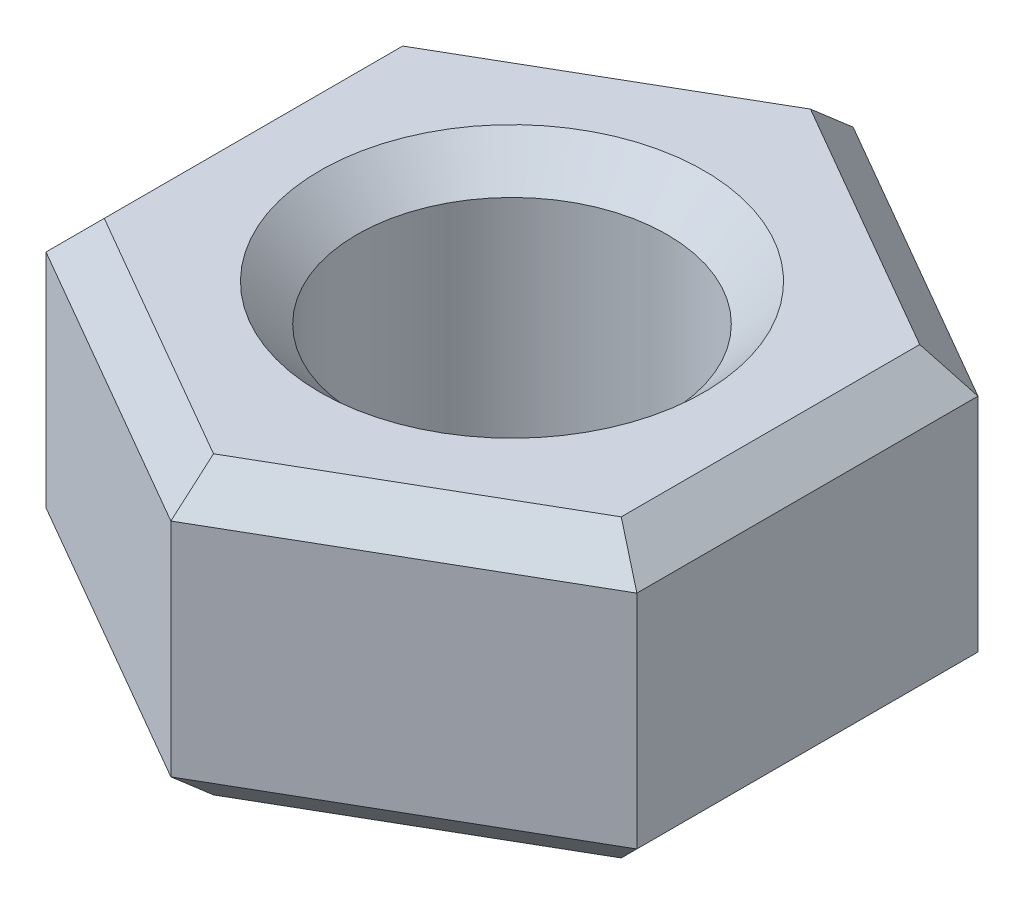
ISO-10303-21;
HEADER;
FILE_DESCRIPTION(('STEP AP214'),'2;1');
FILE_NAME('part.step','',(''),(''),'','','');
FILE_SCHEMA(('AUTOMOTIVE_DESIGN { 1 0 10303 214 1 1 1 1 }'));
ENDSEC;
DATA;
#1=APPLICATION_CONTEXT('core data for automotive mechanical design processes');
#2=APPLICATION_PROTOCOL_DEFINITION('international standard','automotive_design',2000,#1);
#3=PRODUCT_CONTEXT('',#1,'mechanical');
#4=PRODUCT('Part','Part','',(#3));
#5=PRODUCT_RELATED_PRODUCT_CATEGORY('part','',(#4));
#6=PRODUCT_DEFINITION_FORMATION('','',#4);
#7=PRODUCT_DEFINITION_CONTEXT('part definition',#1,'design');
#8=PRODUCT_DEFINITION('design','',#6,#7);
#9=PRODUCT_DEFINITION_SHAPE('','',#8);
#10=(LENGTH_UNIT() NAMED_UNIT(*) SI_UNIT(.MILLI.,.METRE.));
#11=(NAMED_UNIT(*) PLANE_ANGLE_UNIT() SI_UNIT($,.RADIAN.));
#12=(NAMED_UNIT(*) SI_UNIT($,.STERADIAN.) SOLID_ANGLE_UNIT());
#13=UNCERTAINTY_MEASURE_WITH_UNIT(LENGTH_MEASURE(1.E-05),#10,'distance_accuracy_value','');
#14=(GEOMETRIC_REPRESENTATION_CONTEXT(3) GLOBAL_UNCERTAINTY_ASSIGNED_CONTEXT((#13)) GLOBAL_UNIT_ASSIGNED_CONTEXT((#10,
#11,#12)) REPRESENTATION_CONTEXT('',''));
#15=CARTESIAN_POINT('',(0.,0.,0.));
#16=DIRECTION('',(0.,0.,1.));
#17=DIRECTION('',(1.,0.,0.));
#18=AXIS2_PLACEMENT_3D('',#15,#16,#17);
#19=CARTESIAN_POINT('',(0.,4.,-4.61880215351701));
#20=DIRECTION('',(0.,1.,0.));
#21=DIRECTION('',(0.,0.,1.));
#22=AXIS2_PLACEMENT_3D('',#19,#20,#21);
#23=PLANE('',#22);
#24=CARTESIAN_POINT('',(0.,4.00000000007594,0.));
#25=DIRECTION('',(0.,1.,0.));
#26=DIRECTION('',(0.,0.,1.));
#27=AXIS2_PLACEMENT_3D('',#24,#25,#26);
#28=CIRCLE('',#27,2.59999999997262);
#29=CARTESIAN_POINT('',(0.,4.00000000007594,2.59999999997262));
#30=VERTEX_POINT('',#29);
#31=EDGE_CURVE('E20',#30,#30,#28,.F.);
#32=ORIENTED_EDGE('',*,*,#31,.T.);
#33=EDGE_LOOP('',(#32));
#34=FACE_BOUND('',#33,.T.);
#35=DIRECTION('',(0.866025403784439,0.,0.5));
#36=VECTOR('',#35,1.);
#37=CARTESIAN_POINT('',(0.,4.,-4.04145188432738));
#38=LINE('',#37,#36);
#39=CARTESIAN_POINT('',(0.,4.,-4.04145188432738));
#40=VERTEX_POINT('',#39);
#41=CARTESIAN_POINT('',(3.5,4.,-2.02072594216369));
#42=VERTEX_POINT('',#41);
#43=EDGE_CURVE('E139',#40,#42,#38,.T.);
#44=ORIENTED_EDGE('',*,*,#43,.F.);
#45=DIRECTION('',(0.866025403784439,0.,-0.5));
#46=VECTOR('',#45,1.);
#47=CARTESIAN_POINT('',(-3.5,4.,-2.02072594216369));
#48=LINE('',#47,#46);
#49=CARTESIAN_POINT('',(-3.5,4.,-2.02072594216369));
#50=VERTEX_POINT('',#49);
#51=EDGE_CURVE('E121',#50,#40,#48,.T.);
#52=ORIENTED_EDGE('',*,*,#51,.F.);
#53=DIRECTION('',(0.,0.,1.));
#54=VECTOR('',#53,1.);
#55=CARTESIAN_POINT('',(-3.5,4.,-4.61880215351701));
#56=LINE('',#55,#54);
#57=CARTESIAN_POINT('',(-3.5,4.,2.02072594216369));
#58=VERTEX_POINT('',#57);
#59=EDGE_CURVE('E117',#58,#50,#56,.F.);
#60=ORIENTED_EDGE('',*,*,#59,.F.);
#61=DIRECTION('',(-0.866025403784439,0.,-0.5));
#62=VECTOR('',#61,1.);
#63=CARTESIAN_POINT('',(0.,4.,4.04145188432738));
#64=LINE('',#63,#62);
#65=CARTESIAN_POINT('',(0.,4.,4.04145188432738));
#66=VERTEX_POINT('',#65);
#67=EDGE_CURVE('E108',#66,#58,#64,.T.);
#68=ORIENTED_EDGE('',*,*,#67,.F.);
#69=DIRECTION('',(-0.866025403784439,0.,0.5));
#70=VECTOR('',#69,1.);
#71=CARTESIAN_POINT('',(3.5,4.,2.02072594216369));
#72=LINE('',#71,#70);
#73=CARTESIAN_POINT('',(3.5,4.,2.02072594216369));
#74=VERTEX_POINT('',#73);
#75=EDGE_CURVE('E103',#74,#66,#72,.T.);
#76=ORIENTED_EDGE('',*,*,#75,.F.);
#77=DIRECTION('',(0.,0.,1.));
#78=VECTOR('',#77,1.);
#79=CARTESIAN_POINT('',(3.5,4.,-4.61880215351701));
#80=LINE('',#79,#78);
#81=EDGE_CURVE('E133',#42,#74,#80,.T.);
#82=ORIENTED_EDGE('',*,*,#81,.F.);
#83=EDGE_LOOP('',(#44,#52,#60,#68,#76,#82));
#84=FACE_BOUND('',#83,.T.);
#85=ADVANCED_FACE('F17',(#34,#84),#23,.T.);
#86=CARTESIAN_POINT('',(-3.5,4.,-4.61880215351701));
#87=DIRECTION('',(-0.707106781186549,0.707106781186546,0.));
#88=DIRECTION('',(-0.707106781186546,-0.707106781186549,0.));
#89=AXIS2_PLACEMENT_3D('',#86,#87,#88);
#90=PLANE('',#89);
#91=DIRECTION('',(0.654653670707976,0.654653670707978,0.377964473009228));
#92=VECTOR('',#91,1.);
#93=CARTESIAN_POINT('',(-4.,3.5,-2.30940107675851));
#94=LINE('',#93,#92);
#95=CARTESIAN_POINT('',(-4.,3.5,-2.30940107675851));
#96=VERTEX_POINT('',#95);
#97=EDGE_CURVE('E144',#96,#50,#94,.T.);
#98=ORIENTED_EDGE('',*,*,#97,.F.);
#99=DIRECTION('',(0.,0.,-1.));
#100=VECTOR('',#99,1.);
#101=CARTESIAN_POINT('',(-4.,3.5,-2.3094010767585));
#102=LINE('',#101,#100);
#103=CARTESIAN_POINT('',(-4.,3.5,2.3094010767585));
#104=VERTEX_POINT('',#103);
#105=EDGE_CURVE('E127',#96,#104,#102,.F.);
#106=ORIENTED_EDGE('',*,*,#105,.T.);
#107=DIRECTION('',(-0.654653670707976,-0.654653670707978,0.377964473009227));
#108=VECTOR('',#107,1.);
#109=CARTESIAN_POINT('',(-3.5,4.,2.02072594216369));
#110=LINE('',#109,#108);
#111=EDGE_CURVE('E113',#58,#104,#110,.T.);
#112=ORIENTED_EDGE('',*,*,#111,.F.);
#113=ORIENTED_EDGE('',*,*,#59,.T.);
#114=EDGE_LOOP('',(#98,#106,#112,#113));
#115=FACE_BOUND('',#114,.T.);
#116=ADVANCED_FACE('F126',(#115),#90,.T.);
#117=CARTESIAN_POINT('',(-3.75,4.,1.87638837486628));
#118=DIRECTION('',(-0.353553390593274,0.707106781186546,0.612372435695796));
#119=DIRECTION('',(0.,-0.654653670707978,0.755928946018453));
#120=AXIS2_PLACEMENT_3D('',#117,#118,#119);
#121=PLANE('',#120);
#122=ORIENTED_EDGE('',*,*,#111,.T.);
#123=DIRECTION('',(-0.866025403784439,0.,-0.5));
#124=VECTOR('',#123,1.);
#125=CARTESIAN_POINT('',(-4.,3.5,2.3094010767585));
#126=LINE('',#125,#124);
#127=CARTESIAN_POINT('',(0.,3.5,4.61880215351701));
#128=VERTEX_POINT('',#127);
#129=EDGE_CURVE('E156',#104,#128,#126,.F.);
#130=ORIENTED_EDGE('',*,*,#129,.T.);
#131=DIRECTION('',(0.,-0.654653670707978,0.755928946018454));
#132=VECTOR('',#131,1.);
#133=CARTESIAN_POINT('',(0.,5.07142857142857,2.8042727360639));
#134=LINE('',#133,#132);
#135=EDGE_CURVE('E115',#66,#128,#134,.T.);
#136=ORIENTED_EDGE('',*,*,#135,.F.);
#137=ORIENTED_EDGE('',*,*,#67,.T.);
#138=EDGE_LOOP('',(#122,#130,#136,#137));
#139=FACE_BOUND('',#138,.T.);
#140=ADVANCED_FACE('F110',(#139),#121,.T.);
#141=CARTESIAN_POINT('',(3.75,4.,1.87638837486628));
#142=DIRECTION('',(0.353553390593274,0.707106781186547,0.612372435695795));
#143=DIRECTION('',(0.,-0.654653670707978,0.755928946018454));
#144=AXIS2_PLACEMENT_3D('',#141,#142,#143);
#145=PLANE('',#144);
#146=ORIENTED_EDGE('',*,*,#135,.T.);
#147=DIRECTION('',(-0.866025403784439,0.,0.5));
#148=VECTOR('',#147,1.);
#149=CARTESIAN_POINT('',(0.,3.5,4.61880215351701));
#150=LINE('',#149,#148);
#151=CARTESIAN_POINT('',(4.,3.5,2.3094010767585));
#152=VERTEX_POINT('',#151);
#153=EDGE_CURVE('E161',#128,#152,#150,.F.);
#154=ORIENTED_EDGE('',*,*,#153,.T.);
#155=DIRECTION('',(0.654653670707976,-0.654653670707978,0.377964473009227));
#156=VECTOR('',#155,1.);
#157=CARTESIAN_POINT('',(3.5,4.,2.02072594216369));
#158=LINE('',#157,#156);
#159=EDGE_CURVE('E135',#74,#152,#158,.T.);
#160=ORIENTED_EDGE('',*,*,#159,.F.);
#161=ORIENTED_EDGE('',*,*,#75,.T.);
#162=EDGE_LOOP('',(#146,#154,#160,#161));
#163=FACE_BOUND('',#162,.T.);
#164=ADVANCED_FACE('F475',(#163),#145,.T.);
#165=CARTESIAN_POINT('',(3.5,4.,-4.61880215351701));
#166=DIRECTION('',(0.707106781186549,0.707106781186546,0.));
#167=DIRECTION('',(-0.707106781186546,0.707106781186549,0.));
#168=AXIS2_PLACEMENT_3D('',#165,#166,#167);
#169=PLANE('',#168);
#170=ORIENTED_EDGE('',*,*,#159,.T.);
#171=DIRECTION('',(0.,0.,1.));
#172=VECTOR('',#171,1.);
#173=CARTESIAN_POINT('',(4.,3.5,2.3094010767585));
#174=LINE('',#173,#172);
#175=CARTESIAN_POINT('',(4.,3.5,-2.3094010767585));
#176=VERTEX_POINT('',#175);
#177=EDGE_CURVE('E167',#152,#176,#174,.F.);
#178=ORIENTED_EDGE('',*,*,#177,.T.);
#179=DIRECTION('',(0.654653670707977,-0.654653670707978,-0.377964473009227));
#180=VECTOR('',#179,1.);
#181=CARTESIAN_POINT('',(3.5,4.,-2.02072594216369));
#182=LINE('',#181,#180);
#183=EDGE_CURVE('E137',#42,#176,#182,.T.);
#184=ORIENTED_EDGE('',*,*,#183,.F.);
#185=ORIENTED_EDGE('',*,*,#81,.T.);
#186=EDGE_LOOP('',(#170,#178,#184,#185));
#187=FACE_BOUND('',#186,.T.);
#188=ADVANCED_FACE('F466',(#187),#169,.T.);
#189=CARTESIAN_POINT('',(-0.25,4.,-4.18578945162479));
#190=DIRECTION('',(0.353553390593275,0.707106781186546,-0.612372435695796));
#191=DIRECTION('',(0.,0.654653670707979,0.755928946018453));
#192=AXIS2_PLACEMENT_3D('',#189,#190,#191);
#193=PLANE('',#192);
#194=DIRECTION('',(0.,0.654653670707978,0.755928946018454));
#195=VECTOR('',#194,1.);
#196=CARTESIAN_POINT('',(0.,3.92857142857143,-4.12393049421161));
#197=LINE('',#196,#195);
#198=CARTESIAN_POINT('',(0.,3.5,-4.61880215351701));
#199=VERTEX_POINT('',#198);
#200=EDGE_CURVE('E142',#40,#199,#197,.F.);
#201=ORIENTED_EDGE('',*,*,#200,.F.);
#202=ORIENTED_EDGE('',*,*,#43,.T.);
#203=ORIENTED_EDGE('',*,*,#183,.T.);
#204=DIRECTION('',(0.866025403784439,0.,0.5));
#205=VECTOR('',#204,1.);
#206=CARTESIAN_POINT('',(4.,3.5,-2.3094010767585));
#207=LINE('',#206,#205);
#208=EDGE_CURVE('E173',#176,#199,#207,.F.);
#209=ORIENTED_EDGE('',*,*,#208,.T.);
#210=EDGE_LOOP('',(#201,#202,#203,#209));
#211=FACE_BOUND('',#210,.T.);
#212=ADVANCED_FACE('F268',(#211),#193,.T.);
#213=CARTESIAN_POINT('',(0.250000000000002,4.,-4.18578945162479));
#214=DIRECTION('',(-0.353553390593274,0.707106781186547,-0.612372435695795));
#215=DIRECTION('',(0.,0.654653670707978,0.755928946018454));
#216=AXIS2_PLACEMENT_3D('',#213,#214,#215);
#217=PLANE('',#216);
#218=ORIENTED_EDGE('',*,*,#97,.T.);
#219=ORIENTED_EDGE('',*,*,#51,.T.);
#220=ORIENTED_EDGE('',*,*,#200,.T.);
#221=DIRECTION('',(0.866025403784439,0.,-0.5));
#222=VECTOR('',#221,1.);
#223=CARTESIAN_POINT('',(0.,3.5,-4.61880215351701));
#224=LINE('',#223,#222);
#225=EDGE_CURVE('E179',#199,#96,#224,.F.);
#226=ORIENTED_EDGE('',*,*,#225,.T.);
#227=EDGE_LOOP('',(#218,#219,#220,#226));
#228=FACE_BOUND('',#227,.T.);
#229=ADVANCED_FACE('F264',(#228),#217,.T.);
#230=CARTESIAN_POINT('',(0.,4.00000000007594,0.));
#231=DIRECTION('',(0.,1.,0.));
#232=DIRECTION('',(0.,0.,1.));
#233=AXIS2_PLACEMENT_3D('',#230,#231,#232);
#234=CONICAL_SURFACE('',#233,2.59999999997262,0.785398163397448);
#235=CARTESIAN_POINT('',(0.,3.5,0.));
#236=DIRECTION('',(0.,-1.,0.));
#237=DIRECTION('',(0.,0.,-1.));
#238=AXIS2_PLACEMENT_3D('',#235,#236,#237);
#239=CIRCLE('',#238,2.1);
#240=CARTESIAN_POINT('',(0.,3.5,-2.1));
#241=VERTEX_POINT('',#240);
#242=EDGE_CURVE('E147',#241,#241,#239,.T.);
#243=ORIENTED_EDGE('',*,*,#242,.T.);
#244=EDGE_LOOP('',(#243));
#245=FACE_BOUND('',#244,.T.);
#246=ORIENTED_EDGE('',*,*,#31,.F.);
#247=EDGE_LOOP('',(#246));
#248=FACE_BOUND('',#247,.T.);
#249=ADVANCED_FACE('F288',(#245,#248),#234,.F.);
#250=CARTESIAN_POINT('',(-4.,4.,-2.3094010767585));
#251=DIRECTION('',(1.,0.,0.));
#252=DIRECTION('',(0.,0.,-1.));
#253=AXIS2_PLACEMENT_3D('',#250,#251,#252);
#254=PLANE('',#253);
#255=DIRECTION('',(0.,1.,0.));
#256=VECTOR('',#255,1.);
#257=CARTESIAN_POINT('',(-4.,4.,2.3094010767585));
#258=LINE('',#257,#256);
#259=CARTESIAN_POINT('',(-4.,0.499999999999999,2.30940107675851));
#260=VERTEX_POINT('',#259);
#261=EDGE_CURVE('E153',#260,#104,#258,.T.);
#262=ORIENTED_EDGE('',*,*,#261,.T.);
#263=ORIENTED_EDGE('',*,*,#105,.F.);
#264=DIRECTION('',(0.,1.,0.));
#265=VECTOR('',#264,1.);
#266=CARTESIAN_POINT('',(-4.,4.,-2.30940107675851));
#267=LINE('',#266,#265);
#268=CARTESIAN_POINT('',(-4.,0.499999999999999,-2.30940107675851));
#269=VERTEX_POINT('',#268);
#270=EDGE_CURVE('E151',#96,#269,#267,.F.);
#271=ORIENTED_EDGE('',*,*,#270,.T.);
#272=DIRECTION('',(0.,0.,1.));
#273=VECTOR('',#272,1.);
#274=CARTESIAN_POINT('',(-4.,0.499999999999999,-2.3094010767585));
#275=LINE('',#274,#273);
#276=EDGE_CURVE('E150',#269,#260,#275,.T.);
#277=ORIENTED_EDGE('',*,*,#276,.T.);
#278=EDGE_LOOP('',(#262,#263,#271,#277));
#279=FACE_BOUND('',#278,.T.);
#280=ADVANCED_FACE('F259',(#279),#254,.F.);
#281=CARTESIAN_POINT('',(-4.,4.,2.3094010767585));
#282=DIRECTION('',(0.5,0.,-0.866025403784439));
#283=DIRECTION('',(-0.866025403784439,0.,-0.5));
#284=AXIS2_PLACEMENT_3D('',#281,#282,#283);
#285=PLANE('',#284);
#286=DIRECTION('',(0.,1.,0.));
#287=VECTOR('',#286,1.);
#288=CARTESIAN_POINT('',(0.,4.,4.61880215351701));
#289=LINE('',#288,#287);
#290=CARTESIAN_POINT('',(0.,0.499999999999999,4.61880215351701));
#291=VERTEX_POINT('',#290);
#292=EDGE_CURVE('E158',#291,#128,#289,.T.);
#293=ORIENTED_EDGE('',*,*,#292,.T.);
#294=ORIENTED_EDGE('',*,*,#129,.F.);
#295=ORIENTED_EDGE('',*,*,#261,.F.);
#296=DIRECTION('',(0.866025403784439,0.,0.5));
#297=VECTOR('',#296,1.);
#298=CARTESIAN_POINT('',(-4.,0.499999999999999,2.3094010767585));
#299=LINE('',#298,#297);
#300=EDGE_CURVE('E194',#260,#291,#299,.T.);
#301=ORIENTED_EDGE('',*,*,#300,.T.);
#302=EDGE_LOOP('',(#293,#294,#295,#301));
#303=FACE_BOUND('',#302,.T.);
#304=ADVANCED_FACE('F279',(#303),#285,.F.);
#305=CARTESIAN_POINT('',(0.,4.,4.61880215351701));
#306=DIRECTION('',(-0.5,0.,-0.866025403784439));
#307=DIRECTION('',(-0.866025403784439,0.,0.5));
#308=AXIS2_PLACEMENT_3D('',#305,#306,#307);
#309=PLANE('',#308);
#310=DIRECTION('',(0.,1.,0.));
#311=VECTOR('',#310,1.);
#312=CARTESIAN_POINT('',(4.,4.,2.3094010767585));
#313=LINE('',#312,#311);
#314=CARTESIAN_POINT('',(4.,0.499999999999999,2.30940107675851));
#315=VERTEX_POINT('',#314);
#316=EDGE_CURVE('E164',#315,#152,#313,.T.);
#317=ORIENTED_EDGE('',*,*,#316,.T.);
#318=ORIENTED_EDGE('',*,*,#153,.F.);
#319=ORIENTED_EDGE('',*,*,#292,.F.);
#320=DIRECTION('',(0.866025403784439,0.,-0.5));
#321=VECTOR('',#320,1.);
#322=CARTESIAN_POINT('',(0.,0.499999999999998,4.61880215351701));
#323=LINE('',#322,#321);
#324=EDGE_CURVE('E200',#291,#315,#323,.T.);
#325=ORIENTED_EDGE('',*,*,#324,.T.);
#326=EDGE_LOOP('',(#317,#318,#319,#325));
#327=FACE_BOUND('',#326,.T.);
#328=ADVANCED_FACE('F277',(#327),#309,.F.);
#329=CARTESIAN_POINT('',(4.,4.,2.3094010767585));
#330=DIRECTION('',(-1.,0.,0.));
#331=DIRECTION('',(0.,0.,1.));
#332=AXIS2_PLACEMENT_3D('',#329,#330,#331);
#333=PLANE('',#332);
#334=DIRECTION('',(0.,1.,0.));
#335=VECTOR('',#334,1.);
#336=CARTESIAN_POINT('',(4.,4.,-2.3094010767585));
#337=LINE('',#336,#335);
#338=CARTESIAN_POINT('',(4.,0.499999999999999,-2.3094010767585));
#339=VERTEX_POINT('',#338);
#340=EDGE_CURVE('E170',#339,#176,#337,.T.);
#341=ORIENTED_EDGE('',*,*,#340,.T.);
#342=ORIENTED_EDGE('',*,*,#177,.F.);
#343=ORIENTED_EDGE('',*,*,#316,.F.);
#344=DIRECTION('',(0.,0.,1.));
#345=VECTOR('',#344,1.);
#346=CARTESIAN_POINT('',(4.,0.499999999999999,2.3094010767585));
#347=LINE('',#346,#345);
#348=EDGE_CURVE('E206',#315,#339,#347,.F.);
#349=ORIENTED_EDGE('',*,*,#348,.T.);
#350=EDGE_LOOP('',(#341,#342,#343,#349));
#351=FACE_BOUND('',#350,.T.);
#352=ADVANCED_FACE('F274',(#351),#333,.F.);
#353=CARTESIAN_POINT('',(4.,4.,-2.3094010767585));
#354=DIRECTION('',(-0.5,0.,0.866025403784439));
#355=DIRECTION('',(0.866025403784439,0.,0.5));
#356=AXIS2_PLACEMENT_3D('',#353,#354,#355);
#357=PLANE('',#356);
#358=DIRECTION('',(0.,1.,0.));
#359=VECTOR('',#358,1.);
#360=CARTESIAN_POINT('',(0.,4.,-4.61880215351701));
#361=LINE('',#360,#359);
#362=CARTESIAN_POINT('',(0.,0.499999999999998,-4.61880215351701));
#363=VERTEX_POINT('',#362);
#364=EDGE_CURVE('E176',#363,#199,#361,.T.);
#365=ORIENTED_EDGE('',*,*,#364,.T.);
#366=ORIENTED_EDGE('',*,*,#208,.F.);
#367=ORIENTED_EDGE('',*,*,#340,.F.);
#368=DIRECTION('',(-0.866025403784438,0.,-0.5));
#369=VECTOR('',#368,1.);
#370=CARTESIAN_POINT('',(4.,0.499999999999999,-2.3094010767585));
#371=LINE('',#370,#369);
#372=EDGE_CURVE('E212',#339,#363,#371,.T.);
#373=ORIENTED_EDGE('',*,*,#372,.T.);
#374=EDGE_LOOP('',(#365,#366,#367,#373));
#375=FACE_BOUND('',#374,.T.);
#376=ADVANCED_FACE('F271',(#375),#357,.F.);
#377=CARTESIAN_POINT('',(0.,4.,-4.61880215351701));
#378=DIRECTION('',(0.5,0.,0.866025403784439));
#379=DIRECTION('',(0.866025403784439,0.,-0.5));
#380=AXIS2_PLACEMENT_3D('',#377,#378,#379);
#381=PLANE('',#380);
#382=ORIENTED_EDGE('',*,*,#270,.F.);
#383=ORIENTED_EDGE('',*,*,#225,.F.);
#384=ORIENTED_EDGE('',*,*,#364,.F.);
#385=DIRECTION('',(-0.866025403784439,0.,0.5));
#386=VECTOR('',#385,1.);
#387=CARTESIAN_POINT('',(0.,0.499999999999999,-4.61880215351701));
#388=LINE('',#387,#386);
#389=EDGE_CURVE('E216',#363,#269,#388,.T.);
#390=ORIENTED_EDGE('',*,*,#389,.T.);
#391=EDGE_LOOP('',(#382,#383,#384,#390));
#392=FACE_BOUND('',#391,.T.);
#393=ADVANCED_FACE('F262',(#392),#381,.F.);
#394=CARTESIAN_POINT('',(0.,4.,0.));
#395=DIRECTION('',(0.,-1.,0.));
#396=DIRECTION('',(0.,0.,-1.));
#397=AXIS2_PLACEMENT_3D('',#394,#395,#396);
#398=CYLINDRICAL_SURFACE('',#397,2.1);
#399=ORIENTED_EDGE('',*,*,#242,.F.);
#400=EDGE_LOOP('',(#399));
#401=FACE_BOUND('',#400,.T.);
#402=CARTESIAN_POINT('',(0.,0.50000000004502,0.));
#403=DIRECTION('',(0.,-1.,0.));
#404=DIRECTION('',(0.,0.,-1.));
#405=AXIS2_PLACEMENT_3D('',#402,#403,#404);
#406=CIRCLE('',#405,2.09999999998445);
#407=CARTESIAN_POINT('',(0.,0.50000000004502,-2.09999999998445));
#408=VERTEX_POINT('',#407);
#409=EDGE_CURVE('E184',#408,#408,#406,.T.);
#410=ORIENTED_EDGE('',*,*,#409,.T.);
#411=EDGE_LOOP('',(#410));
#412=FACE_BOUND('',#411,.T.);
#413=ADVANCED_FACE('F313',(#401,#412),#398,.F.);
#414=CARTESIAN_POINT('',(-4.,0.499999999999999,-2.3094010767585));
#415=DIRECTION('',(0.707106781186546,0.707106781186549,0.));
#416=DIRECTION('',(-0.707106781186549,0.707106781186546,0.));
#417=AXIS2_PLACEMENT_3D('',#414,#415,#416);
#418=PLANE('',#417);
#419=DIRECTION('',(0.654653670707978,-0.654653670707975,0.377964473009228));
#420=VECTOR('',#419,1.);
#421=CARTESIAN_POINT('',(-4.,0.499999999999998,-2.30940107675851));
#422=LINE('',#421,#420);
#423=CARTESIAN_POINT('',(-3.5,0.,-2.02072594216369));
#424=VERTEX_POINT('',#423);
#425=EDGE_CURVE('E188',#269,#424,#422,.T.);
#426=ORIENTED_EDGE('',*,*,#425,.T.);
#427=DIRECTION('',(0.,0.,1.));
#428=VECTOR('',#427,1.);
#429=CARTESIAN_POINT('',(-3.5,0.,-4.61880215351701));
#430=LINE('',#429,#428);
#431=CARTESIAN_POINT('',(-3.5,0.,2.02072594216369));
#432=VERTEX_POINT('',#431);
#433=EDGE_CURVE('E187',#424,#432,#430,.T.);
#434=ORIENTED_EDGE('',*,*,#433,.T.);
#435=DIRECTION('',(-0.654653670707979,0.654653670707976,0.377964473009227));
#436=VECTOR('',#435,1.);
#437=CARTESIAN_POINT('',(-3.5,0.,2.02072594216369));
#438=LINE('',#437,#436);
#439=EDGE_CURVE('E191',#432,#260,#438,.T.);
#440=ORIENTED_EDGE('',*,*,#439,.T.);
#441=ORIENTED_EDGE('',*,*,#276,.F.);
#442=EDGE_LOOP('',(#426,#434,#440,#441));
#443=FACE_BOUND('',#442,.T.);
#444=ADVANCED_FACE('F256',(#443),#418,.F.);
#445=CARTESIAN_POINT('',(-4.,0.499999999999999,2.3094010767585));
#446=DIRECTION('',(0.353553390593273,0.707106781186549,-0.612372435695794));
#447=DIRECTION('',(0.,0.654653670707976,0.755928946018456));
#448=AXIS2_PLACEMENT_3D('',#445,#446,#447);
#449=PLANE('',#448);
#450=ORIENTED_EDGE('',*,*,#439,.F.);
#451=DIRECTION('',(0.866025403784439,0.,0.5));
#452=VECTOR('',#451,1.);
#453=CARTESIAN_POINT('',(-3.5,0.,2.02072594216369));
#454=LINE('',#453,#452);
#455=CARTESIAN_POINT('',(0.,0.,4.04145188432738));
#456=VERTEX_POINT('',#455);
#457=EDGE_CURVE('E223',#432,#456,#454,.T.);
#458=ORIENTED_EDGE('',*,*,#457,.T.);
#459=DIRECTION('',(0.,0.654653670707977,0.755928946018455));
#460=VECTOR('',#459,1.);
#461=CARTESIAN_POINT('',(0.,0.499999999999999,4.61880215351701));
#462=LINE('',#461,#460);
#463=EDGE_CURVE('E197',#456,#291,#462,.T.);
#464=ORIENTED_EDGE('',*,*,#463,.T.);
#465=ORIENTED_EDGE('',*,*,#300,.F.);
#466=EDGE_LOOP('',(#450,#458,#464,#465));
#467=FACE_BOUND('',#466,.T.);
#468=ADVANCED_FACE('F254',(#467),#449,.F.);
#469=CARTESIAN_POINT('',(0.,0.499999999999999,4.61880215351701));
#470=DIRECTION('',(-0.353553390593273,0.707106781186548,-0.612372435695794));
#471=DIRECTION('',(0.,0.654653670707977,0.755928946018455));
#472=AXIS2_PLACEMENT_3D('',#469,#470,#471);
#473=PLANE('',#472);
#474=DIRECTION('',(0.654653670707978,0.654653670707976,0.377964473009228));
#475=VECTOR('',#474,1.);
#476=CARTESIAN_POINT('',(3.5,0.,2.02072594216369));
#477=LINE('',#476,#475);
#478=CARTESIAN_POINT('',(3.5,0.,2.02072594216369));
#479=VERTEX_POINT('',#478);
#480=EDGE_CURVE('E203',#479,#315,#477,.T.);
#481=ORIENTED_EDGE('',*,*,#480,.T.);
#482=ORIENTED_EDGE('',*,*,#324,.F.);
#483=ORIENTED_EDGE('',*,*,#463,.F.);
#484=DIRECTION('',(0.866025403784438,0.,-0.5));
#485=VECTOR('',#484,1.);
#486=CARTESIAN_POINT('',(0.,0.,4.04145188432738));
#487=LINE('',#486,#485);
#488=EDGE_CURVE('E226',#456,#479,#487,.T.);
#489=ORIENTED_EDGE('',*,*,#488,.T.);
#490=EDGE_LOOP('',(#481,#482,#483,#489));
#491=FACE_BOUND('',#490,.T.);
#492=ADVANCED_FACE('F250',(#491),#473,.F.);
#493=CARTESIAN_POINT('',(4.,0.499999999999999,2.3094010767585));
#494=DIRECTION('',(-0.707106781186546,0.707106781186549,0.));
#495=DIRECTION('',(-0.707106781186549,-0.707106781186546,0.));
#496=AXIS2_PLACEMENT_3D('',#493,#494,#495);
#497=PLANE('',#496);
#498=DIRECTION('',(0.654653670707979,0.654653670707976,-0.377964473009227));
#499=VECTOR('',#498,1.);
#500=CARTESIAN_POINT('',(3.5,0.,-2.02072594216369));
#501=LINE('',#500,#499);
#502=CARTESIAN_POINT('',(3.5,0.,-2.02072594216369));
#503=VERTEX_POINT('',#502);
#504=EDGE_CURVE('E209',#503,#339,#501,.T.);
#505=ORIENTED_EDGE('',*,*,#504,.T.);
#506=ORIENTED_EDGE('',*,*,#348,.F.);
#507=ORIENTED_EDGE('',*,*,#480,.F.);
#508=DIRECTION('',(0.,0.,1.));
#509=VECTOR('',#508,1.);
#510=CARTESIAN_POINT('',(3.5,0.,-4.61880215351701));
#511=LINE('',#510,#509);
#512=EDGE_CURVE('E229',#479,#503,#511,.F.);
#513=ORIENTED_EDGE('',*,*,#512,.T.);
#514=EDGE_LOOP('',(#505,#506,#507,#513));
#515=FACE_BOUND('',#514,.T.);
#516=ADVANCED_FACE('F247',(#515),#497,.F.);
#517=CARTESIAN_POINT('',(4.,0.499999999999999,-2.3094010767585));
#518=DIRECTION('',(-0.353553390593273,0.707106781186548,0.612372435695794));
#519=DIRECTION('',(0.,-0.654653670707976,0.755928946018455));
#520=AXIS2_PLACEMENT_3D('',#517,#518,#519);
#521=PLANE('',#520);
#522=DIRECTION('',(0.,-0.654653670707976,0.755928946018456));
#523=VECTOR('',#522,1.);
#524=CARTESIAN_POINT('',(0.,0.499999999999999,-4.61880215351701));
#525=LINE('',#524,#523);
#526=CARTESIAN_POINT('',(0.,0.,-4.04145188432738));
#527=VERTEX_POINT('',#526);
#528=EDGE_CURVE('E34',#527,#363,#525,.F.);
#529=ORIENTED_EDGE('',*,*,#528,.T.);
#530=ORIENTED_EDGE('',*,*,#372,.F.);
#531=ORIENTED_EDGE('',*,*,#504,.F.);
#532=DIRECTION('',(-0.866025403784439,0.,-0.5));
#533=VECTOR('',#532,1.);
#534=CARTESIAN_POINT('',(3.5,0.,-2.02072594216369));
#535=LINE('',#534,#533);
#536=EDGE_CURVE('E232',#503,#527,#535,.T.);
#537=ORIENTED_EDGE('',*,*,#536,.T.);
#538=EDGE_LOOP('',(#529,#530,#531,#537));
#539=FACE_BOUND('',#538,.T.);
#540=ADVANCED_FACE('F243',(#539),#521,.F.);
#541=CARTESIAN_POINT('',(0.,0.499999999999999,-4.61880215351701));
#542=DIRECTION('',(0.353553390593273,0.707106781186549,0.612372435695793));
#543=DIRECTION('',(0.,-0.654653670707976,0.755928946018456));
#544=AXIS2_PLACEMENT_3D('',#541,#542,#543);
#545=PLANE('',#544);
#546=ORIENTED_EDGE('',*,*,#425,.F.);
#547=ORIENTED_EDGE('',*,*,#389,.F.);
#548=ORIENTED_EDGE('',*,*,#528,.F.);
#549=DIRECTION('',(-0.866025403784439,0.,0.5));
#550=VECTOR('',#549,1.);
#551=CARTESIAN_POINT('',(0.,0.,-4.04145188432738));
#552=LINE('',#551,#550);
#553=EDGE_CURVE('E26',#527,#424,#552,.T.);
#554=ORIENTED_EDGE('',*,*,#553,.T.);
#555=EDGE_LOOP('',(#546,#547,#548,#554));
#556=FACE_BOUND('',#555,.T.);
#557=ADVANCED_FACE('F236',(#556),#545,.F.);
#558=CARTESIAN_POINT('',(0.,1.13686837721616E-10,0.));
#559=DIRECTION('',(0.,-1.,0.));
#560=DIRECTION('',(0.,0.,-1.));
#561=AXIS2_PLACEMENT_3D('',#558,#559,#560);
#562=CONICAL_SURFACE('',#561,2.59999999991578,0.785398163340605);
#563=ORIENTED_EDGE('',*,*,#409,.F.);
#564=EDGE_LOOP('',(#563));
#565=FACE_BOUND('',#564,.T.);
#566=CARTESIAN_POINT('',(0.,5.6843418860808E-11,0.));
#567=DIRECTION('',(0.,-1.,0.));
#568=DIRECTION('',(0.,0.,-1.));
#569=AXIS2_PLACEMENT_3D('',#566,#567,#568);
#570=CIRCLE('',#569,2.59999999997262);
#571=CARTESIAN_POINT('',(0.,5.6843418860808E-11,-2.59999999997262));
#572=VERTEX_POINT('',#571);
#573=EDGE_CURVE('E11',#572,#572,#570,.T.);
#574=ORIENTED_EDGE('',*,*,#573,.T.);
#575=EDGE_LOOP('',(#574));
#576=FACE_BOUND('',#575,.T.);
#577=ADVANCED_FACE('F291',(#565,#576),#562,.F.);
#578=CARTESIAN_POINT('',(0.,0.,-4.61880215351701));
#579=DIRECTION('',(0.,1.,0.));
#580=DIRECTION('',(0.,0.,1.));
#581=AXIS2_PLACEMENT_3D('',#578,#579,#580);
#582=PLANE('',#581);
#583=ORIENTED_EDGE('',*,*,#573,.F.);
#584=EDGE_LOOP('',(#583));
#585=FACE_BOUND('',#584,.T.);
#586=ORIENTED_EDGE('',*,*,#536,.F.);
#587=ORIENTED_EDGE('',*,*,#512,.F.);
#588=ORIENTED_EDGE('',*,*,#488,.F.);
#589=ORIENTED_EDGE('',*,*,#457,.F.);
#590=ORIENTED_EDGE('',*,*,#433,.F.);
#591=ORIENTED_EDGE('',*,*,#553,.F.);
#592=EDGE_LOOP('',(#586,#587,#588,#589,#590,#591));
#593=FACE_BOUND('',#592,.T.);
#594=ADVANCED_FACE('F239',(#585,#593),#582,.F.);
#595=CLOSED_SHELL('',(#85,#116,#140,#164,#188,#212,#229,#249,#280,#304,#328,#352,#376,#393,#413,
#444,#468,#492,#516,#540,#557,#577,#594));
#596=MANIFOLD_SOLID_BREP('B1',#595);
#597=ADVANCED_BREP_SHAPE_REPRESENTATION('',(#18,#596),#14);
#598=SHAPE_DEFINITION_REPRESENTATION(#9,#597);
ENDSEC;
END-ISO-10303-21;
